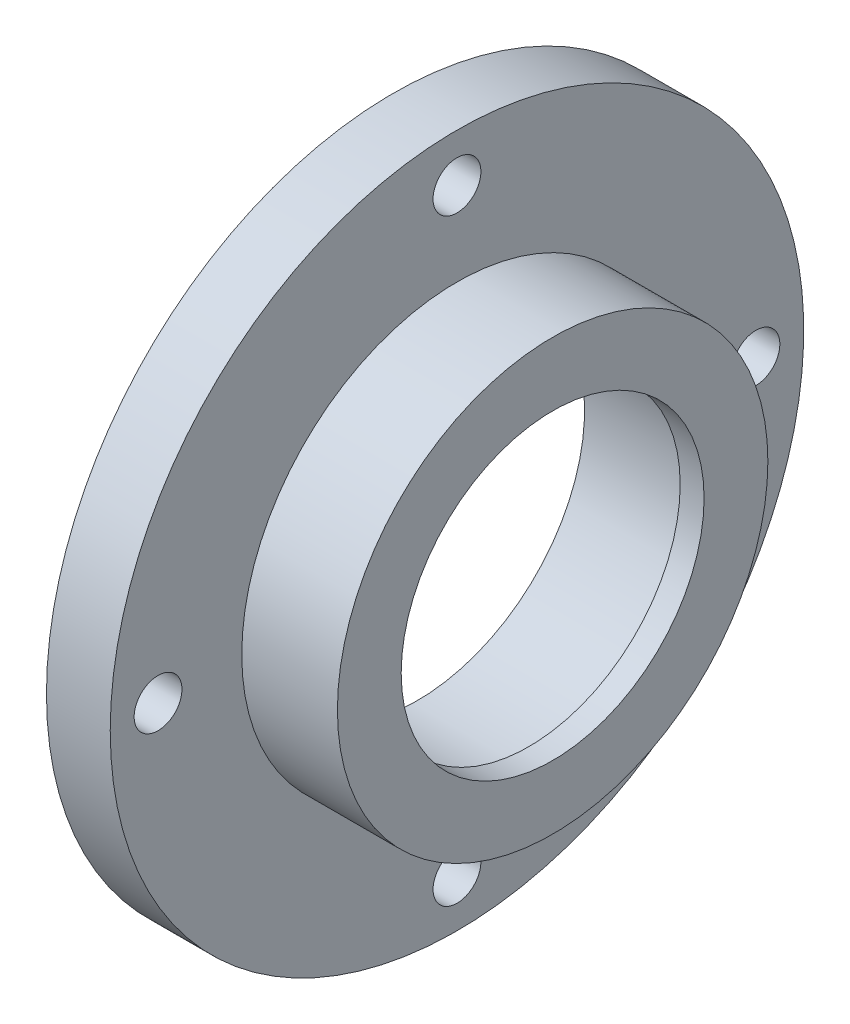
ISO-10303-21;
HEADER;
FILE_DESCRIPTION(('STEP AP214'),'2;1');
FILE_NAME('part.step','',(''),(''),'','','');
FILE_SCHEMA(('AUTOMOTIVE_DESIGN { 1 0 10303 214 1 1 1 1 }'));
ENDSEC;
DATA;
#1=APPLICATION_CONTEXT('core data for automotive mechanical design processes');
#2=APPLICATION_PROTOCOL_DEFINITION('international standard','automotive_design',2000,#1);
#3=PRODUCT_CONTEXT('',#1,'mechanical');
#4=PRODUCT('Part','Part','',(#3));
#5=PRODUCT_RELATED_PRODUCT_CATEGORY('part','',(#4));
#6=PRODUCT_DEFINITION_FORMATION('','',#4);
#7=PRODUCT_DEFINITION_CONTEXT('part definition',#1,'design');
#8=PRODUCT_DEFINITION('design','',#6,#7);
#9=PRODUCT_DEFINITION_SHAPE('','',#8);
#10=(LENGTH_UNIT() NAMED_UNIT(*) SI_UNIT(.MILLI.,.METRE.));
#11=(NAMED_UNIT(*) PLANE_ANGLE_UNIT() SI_UNIT($,.RADIAN.));
#12=(NAMED_UNIT(*) SI_UNIT($,.STERADIAN.) SOLID_ANGLE_UNIT());
#13=UNCERTAINTY_MEASURE_WITH_UNIT(LENGTH_MEASURE(1.E-05),#10,'distance_accuracy_value','');
#14=(GEOMETRIC_REPRESENTATION_CONTEXT(3) GLOBAL_UNCERTAINTY_ASSIGNED_CONTEXT((#13)) GLOBAL_UNIT_ASSIGNED_CONTEXT((#10,
#11,#12)) REPRESENTATION_CONTEXT('',''));
#15=CARTESIAN_POINT('',(0.,0.,0.));
#16=DIRECTION('',(0.,0.,1.));
#17=DIRECTION('',(1.,0.,0.));
#18=AXIS2_PLACEMENT_3D('',#15,#16,#17);
#19=CARTESIAN_POINT('',(8.,0.,-43.5));
#20=DIRECTION('',(-1.,0.,0.));
#21=DIRECTION('',(0.,0.,1.));
#22=AXIS2_PLACEMENT_3D('',#19,#20,#21);
#23=PLANE('',#22);
#24=CARTESIAN_POINT('',(8.,1.20241174019601E-12,37.5000000000012));
#25=DIRECTION('',(-1.,0.,0.));
#26=DIRECTION('',(0.,0.,1.));
#27=AXIS2_PLACEMENT_3D('',#24,#25,#26);
#28=CIRCLE('',#27,3.);
#29=CARTESIAN_POINT('',(8.,1.20241174019601E-12,40.5000000000012));
#30=VERTEX_POINT('',#29);
#31=EDGE_CURVE('E89',#30,#30,#28,.F.);
#32=ORIENTED_EDGE('',*,*,#31,.F.);
#33=EDGE_LOOP('',(#32));
#34=FACE_BOUND('',#33,.T.);
#35=CARTESIAN_POINT('',(8.,-1.20700416569281E-12,-37.4999999999988));
#36=DIRECTION('',(-1.,0.,0.));
#37=DIRECTION('',(0.,0.,1.));
#38=AXIS2_PLACEMENT_3D('',#35,#36,#37);
#39=CIRCLE('',#38,3.);
#40=CARTESIAN_POINT('',(8.,-1.20700416569281E-12,-34.4999999999988));
#41=VERTEX_POINT('',#40);
#42=EDGE_CURVE('E83',#41,#41,#39,.F.);
#43=ORIENTED_EDGE('',*,*,#42,.F.);
#44=EDGE_LOOP('',(#43));
#45=FACE_BOUND('',#44,.T.);
#46=CARTESIAN_POINT('',(8.,37.5,0.));
#47=DIRECTION('',(-1.,0.,0.));
#48=DIRECTION('',(0.,0.,1.));
#49=AXIS2_PLACEMENT_3D('',#46,#47,#48);
#50=CIRCLE('',#49,3.);
#51=CARTESIAN_POINT('',(8.,37.5,3.));
#52=VERTEX_POINT('',#51);
#53=EDGE_CURVE('E77',#52,#52,#50,.F.);
#54=ORIENTED_EDGE('',*,*,#53,.F.);
#55=EDGE_LOOP('',(#54));
#56=FACE_BOUND('',#55,.T.);
#57=CARTESIAN_POINT('',(8.,-37.5,2.40482348039201E-12));
#58=DIRECTION('',(-1.,0.,0.));
#59=DIRECTION('',(0.,0.,1.));
#60=AXIS2_PLACEMENT_3D('',#57,#58,#59);
#61=CIRCLE('',#60,3.);
#62=CARTESIAN_POINT('',(8.,-37.5,3.00000000000241));
#63=VERTEX_POINT('',#62);
#64=EDGE_CURVE('E68',#63,#63,#61,.F.);
#65=ORIENTED_EDGE('',*,*,#64,.F.);
#66=EDGE_LOOP('',(#65));
#67=FACE_BOUND('',#66,.T.);
#68=CARTESIAN_POINT('',(8.,0.,0.));
#69=DIRECTION('',(-1.,0.,0.));
#70=DIRECTION('',(0.,0.,1.));
#71=AXIS2_PLACEMENT_3D('',#68,#69,#70);
#72=CIRCLE('',#71,43.5);
#73=CARTESIAN_POINT('',(8.,0.,43.5));
#74=VERTEX_POINT('',#73);
#75=EDGE_CURVE('E10',#74,#74,#72,.T.);
#76=ORIENTED_EDGE('',*,*,#75,.F.);
#77=EDGE_LOOP('',(#76));
#78=FACE_BOUND('',#77,.T.);
#79=CARTESIAN_POINT('',(8.,0.,0.));
#80=DIRECTION('',(-1.,0.,0.));
#81=DIRECTION('',(0.,0.,1.));
#82=AXIS2_PLACEMENT_3D('',#79,#80,#81);
#83=CIRCLE('',#82,27.);
#84=CARTESIAN_POINT('',(8.,0.,27.));
#85=VERTEX_POINT('',#84);
#86=EDGE_CURVE('E65',#85,#85,#83,.T.);
#87=ORIENTED_EDGE('',*,*,#86,.T.);
#88=EDGE_LOOP('',(#87));
#89=FACE_BOUND('',#88,.T.);
#90=ADVANCED_FACE('F31',(#34,#45,#56,#67,#78,#89),#23,.F.);
#91=CARTESIAN_POINT('',(0.,0.,0.));
#92=DIRECTION('',(-1.,0.,0.));
#93=DIRECTION('',(0.,0.,1.));
#94=AXIS2_PLACEMENT_3D('',#91,#92,#93);
#95=CYLINDRICAL_SURFACE('',#94,43.5);
#96=CARTESIAN_POINT('',(0.,0.,0.));
#97=DIRECTION('',(-1.,0.,0.));
#98=DIRECTION('',(0.,0.,1.));
#99=AXIS2_PLACEMENT_3D('',#96,#97,#98);
#100=CIRCLE('',#99,43.5);
#101=CARTESIAN_POINT('',(0.,0.,43.5));
#102=VERTEX_POINT('',#101);
#103=EDGE_CURVE('E37',#102,#102,#100,.T.);
#104=ORIENTED_EDGE('',*,*,#103,.F.);
#105=EDGE_LOOP('',(#104));
#106=FACE_BOUND('',#105,.T.);
#107=ORIENTED_EDGE('',*,*,#75,.T.);
#108=EDGE_LOOP('',(#107));
#109=FACE_BOUND('',#108,.T.);
#110=ADVANCED_FACE('F97',(#106,#109),#95,.T.);
#111=CARTESIAN_POINT('',(0.,0.,-30.));
#112=DIRECTION('',(1.,0.,0.));
#113=DIRECTION('',(0.,0.,-1.));
#114=AXIS2_PLACEMENT_3D('',#111,#112,#113);
#115=PLANE('',#114);
#116=CARTESIAN_POINT('',(0.,1.20241174019601E-12,37.5000000000012));
#117=DIRECTION('',(-1.,0.,0.));
#118=DIRECTION('',(0.,0.,1.));
#119=AXIS2_PLACEMENT_3D('',#116,#117,#118);
#120=CIRCLE('',#119,3.);
#121=CARTESIAN_POINT('',(0.,1.20241174019601E-12,40.5000000000012));
#122=VERTEX_POINT('',#121);
#123=EDGE_CURVE('E86',#122,#122,#120,.T.);
#124=ORIENTED_EDGE('',*,*,#123,.F.);
#125=EDGE_LOOP('',(#124));
#126=FACE_BOUND('',#125,.T.);
#127=CARTESIAN_POINT('',(0.,-1.20700416569281E-12,-37.4999999999988));
#128=DIRECTION('',(-1.,0.,0.));
#129=DIRECTION('',(0.,0.,1.));
#130=AXIS2_PLACEMENT_3D('',#127,#128,#129);
#131=CIRCLE('',#130,3.);
#132=CARTESIAN_POINT('',(0.,-1.20700416569281E-12,-34.4999999999988));
#133=VERTEX_POINT('',#132);
#134=EDGE_CURVE('E80',#133,#133,#131,.T.);
#135=ORIENTED_EDGE('',*,*,#134,.F.);
#136=EDGE_LOOP('',(#135));
#137=FACE_BOUND('',#136,.T.);
#138=CARTESIAN_POINT('',(0.,37.5,0.));
#139=DIRECTION('',(-1.,0.,0.));
#140=DIRECTION('',(0.,0.,1.));
#141=AXIS2_PLACEMENT_3D('',#138,#139,#140);
#142=CIRCLE('',#141,3.);
#143=CARTESIAN_POINT('',(0.,37.5,3.));
#144=VERTEX_POINT('',#143);
#145=EDGE_CURVE('E74',#144,#144,#142,.T.);
#146=ORIENTED_EDGE('',*,*,#145,.F.);
#147=EDGE_LOOP('',(#146));
#148=FACE_BOUND('',#147,.T.);
#149=CARTESIAN_POINT('',(0.,-37.5,2.40482348039201E-12));
#150=DIRECTION('',(-1.,0.,0.));
#151=DIRECTION('',(0.,0.,1.));
#152=AXIS2_PLACEMENT_3D('',#149,#150,#151);
#153=CIRCLE('',#152,3.);
#154=CARTESIAN_POINT('',(0.,-37.5,3.00000000000241));
#155=VERTEX_POINT('',#154);
#156=EDGE_CURVE('E71',#155,#155,#153,.T.);
#157=ORIENTED_EDGE('',*,*,#156,.F.);
#158=EDGE_LOOP('',(#157));
#159=FACE_BOUND('',#158,.T.);
#160=CARTESIAN_POINT('',(0.,0.,0.));
#161=DIRECTION('',(-1.,0.,0.));
#162=DIRECTION('',(0.,0.,1.));
#163=AXIS2_PLACEMENT_3D('',#160,#161,#162);
#164=CIRCLE('',#163,30.);
#165=CARTESIAN_POINT('',(0.,0.,30.));
#166=VERTEX_POINT('',#165);
#167=EDGE_CURVE('E41',#166,#166,#164,.T.);
#168=ORIENTED_EDGE('',*,*,#167,.F.);
#169=EDGE_LOOP('',(#168));
#170=FACE_BOUND('',#169,.T.);
#171=ORIENTED_EDGE('',*,*,#103,.T.);
#172=EDGE_LOOP('',(#171));
#173=FACE_BOUND('',#172,.T.);
#174=ADVANCED_FACE('F147',(#126,#137,#148,#159,#170,#173),#115,.F.);
#175=CARTESIAN_POINT('',(0.,0.,0.));
#176=DIRECTION('',(-1.,0.,0.));
#177=DIRECTION('',(0.,0.,1.));
#178=AXIS2_PLACEMENT_3D('',#175,#176,#177);
#179=CYLINDRICAL_SURFACE('',#178,30.);
#180=CARTESIAN_POINT('',(3.,0.,0.));
#181=DIRECTION('',(-1.,0.,0.));
#182=DIRECTION('',(0.,0.,1.));
#183=AXIS2_PLACEMENT_3D('',#180,#181,#182);
#184=CIRCLE('',#183,30.);
#185=CARTESIAN_POINT('',(3.,0.,30.));
#186=VERTEX_POINT('',#185);
#187=EDGE_CURVE('E45',#186,#186,#184,.T.);
#188=ORIENTED_EDGE('',*,*,#187,.F.);
#189=EDGE_LOOP('',(#188));
#190=FACE_BOUND('',#189,.T.);
#191=ORIENTED_EDGE('',*,*,#167,.T.);
#192=EDGE_LOOP('',(#191));
#193=FACE_BOUND('',#192,.T.);
#194=ADVANCED_FACE('F141',(#190,#193),#179,.F.);
#195=CARTESIAN_POINT('',(3.,0.,-30.));
#196=DIRECTION('',(1.,0.,0.));
#197=DIRECTION('',(0.,0.,-1.));
#198=AXIS2_PLACEMENT_3D('',#195,#196,#197);
#199=PLANE('',#198);
#200=CARTESIAN_POINT('',(3.,0.,0.));
#201=DIRECTION('',(-1.,0.,0.));
#202=DIRECTION('',(0.,0.,1.));
#203=AXIS2_PLACEMENT_3D('',#200,#201,#202);
#204=CIRCLE('',#203,21.);
#205=CARTESIAN_POINT('',(3.,0.,21.));
#206=VERTEX_POINT('',#205);
#207=EDGE_CURVE('E50',#206,#206,#204,.T.);
#208=ORIENTED_EDGE('',*,*,#207,.F.);
#209=EDGE_LOOP('',(#208));
#210=FACE_BOUND('',#209,.T.);
#211=ORIENTED_EDGE('',*,*,#187,.T.);
#212=EDGE_LOOP('',(#211));
#213=FACE_BOUND('',#212,.T.);
#214=ADVANCED_FACE('F135',(#210,#213),#199,.F.);
#215=CARTESIAN_POINT('',(0.,0.,0.));
#216=DIRECTION('',(-1.,0.,0.));
#217=DIRECTION('',(0.,0.,1.));
#218=AXIS2_PLACEMENT_3D('',#215,#216,#217);
#219=CYLINDRICAL_SURFACE('',#218,21.);
#220=CARTESIAN_POINT('',(17.,0.,0.));
#221=DIRECTION('',(-1.,0.,0.));
#222=DIRECTION('',(0.,0.,1.));
#223=AXIS2_PLACEMENT_3D('',#220,#221,#222);
#224=CIRCLE('',#223,21.);
#225=CARTESIAN_POINT('',(17.,0.,21.));
#226=VERTEX_POINT('',#225);
#227=EDGE_CURVE('E53',#226,#226,#224,.T.);
#228=ORIENTED_EDGE('',*,*,#227,.F.);
#229=EDGE_LOOP('',(#228));
#230=FACE_BOUND('',#229,.T.);
#231=ORIENTED_EDGE('',*,*,#207,.T.);
#232=EDGE_LOOP('',(#231));
#233=FACE_BOUND('',#232,.T.);
#234=ADVANCED_FACE('F129',(#230,#233),#219,.F.);
#235=CARTESIAN_POINT('',(17.,0.,-18.9999999999999));
#236=DIRECTION('',(1.,0.,0.));
#237=DIRECTION('',(0.,0.,-1.));
#238=AXIS2_PLACEMENT_3D('',#235,#236,#237);
#239=PLANE('',#238);
#240=CARTESIAN_POINT('',(17.,0.,0.));
#241=DIRECTION('',(-1.,0.,0.));
#242=DIRECTION('',(0.,0.,1.));
#243=AXIS2_PLACEMENT_3D('',#240,#241,#242);
#244=CIRCLE('',#243,18.9999999999999);
#245=CARTESIAN_POINT('',(17.,0.,18.9999999999999));
#246=VERTEX_POINT('',#245);
#247=EDGE_CURVE('E56',#246,#246,#244,.T.);
#248=ORIENTED_EDGE('',*,*,#247,.F.);
#249=EDGE_LOOP('',(#248));
#250=FACE_BOUND('',#249,.T.);
#251=ORIENTED_EDGE('',*,*,#227,.T.);
#252=EDGE_LOOP('',(#251));
#253=FACE_BOUND('',#252,.T.);
#254=ADVANCED_FACE('F123',(#250,#253),#239,.F.);
#255=CARTESIAN_POINT('',(0.,0.,0.));
#256=DIRECTION('',(-1.,0.,0.));
#257=DIRECTION('',(0.,0.,1.));
#258=AXIS2_PLACEMENT_3D('',#255,#256,#257);
#259=CYLINDRICAL_SURFACE('',#258,18.9999999999999);
#260=CARTESIAN_POINT('',(20.,0.,0.));
#261=DIRECTION('',(-1.,0.,0.));
#262=DIRECTION('',(0.,0.,1.));
#263=AXIS2_PLACEMENT_3D('',#260,#261,#262);
#264=CIRCLE('',#263,18.9999999999999);
#265=CARTESIAN_POINT('',(20.,0.,18.9999999999999));
#266=VERTEX_POINT('',#265);
#267=EDGE_CURVE('E59',#266,#266,#264,.T.);
#268=ORIENTED_EDGE('',*,*,#267,.F.);
#269=EDGE_LOOP('',(#268));
#270=FACE_BOUND('',#269,.T.);
#271=ORIENTED_EDGE('',*,*,#247,.T.);
#272=EDGE_LOOP('',(#271));
#273=FACE_BOUND('',#272,.T.);
#274=ADVANCED_FACE('F117',(#270,#273),#259,.F.);
#275=CARTESIAN_POINT('',(20.,0.,-27.));
#276=DIRECTION('',(-1.,0.,0.));
#277=DIRECTION('',(0.,0.,1.));
#278=AXIS2_PLACEMENT_3D('',#275,#276,#277);
#279=PLANE('',#278);
#280=CARTESIAN_POINT('',(20.,0.,0.));
#281=DIRECTION('',(-1.,0.,0.));
#282=DIRECTION('',(0.,0.,1.));
#283=AXIS2_PLACEMENT_3D('',#280,#281,#282);
#284=CIRCLE('',#283,27.);
#285=CARTESIAN_POINT('',(20.,0.,27.));
#286=VERTEX_POINT('',#285);
#287=EDGE_CURVE('E62',#286,#286,#284,.T.);
#288=ORIENTED_EDGE('',*,*,#287,.F.);
#289=EDGE_LOOP('',(#288));
#290=FACE_BOUND('',#289,.T.);
#291=ORIENTED_EDGE('',*,*,#267,.T.);
#292=EDGE_LOOP('',(#291));
#293=FACE_BOUND('',#292,.T.);
#294=ADVANCED_FACE('F111',(#290,#293),#279,.F.);
#295=CARTESIAN_POINT('',(0.,0.,0.));
#296=DIRECTION('',(-1.,0.,0.));
#297=DIRECTION('',(0.,0.,1.));
#298=AXIS2_PLACEMENT_3D('',#295,#296,#297);
#299=CYLINDRICAL_SURFACE('',#298,27.);
#300=ORIENTED_EDGE('',*,*,#86,.F.);
#301=EDGE_LOOP('',(#300));
#302=FACE_BOUND('',#301,.T.);
#303=ORIENTED_EDGE('',*,*,#287,.T.);
#304=EDGE_LOOP('',(#303));
#305=FACE_BOUND('',#304,.T.);
#306=ADVANCED_FACE('F107',(#302,#305),#299,.T.);
#307=CARTESIAN_POINT('',(20.001,-37.5,2.40482348039201E-12));
#308=DIRECTION('',(-1.,0.,0.));
#309=DIRECTION('',(0.,0.,1.));
#310=AXIS2_PLACEMENT_3D('',#307,#308,#309);
#311=CYLINDRICAL_SURFACE('',#310,3.);
#312=ORIENTED_EDGE('',*,*,#156,.T.);
#313=EDGE_LOOP('',(#312));
#314=FACE_BOUND('',#313,.T.);
#315=ORIENTED_EDGE('',*,*,#64,.T.);
#316=EDGE_LOOP('',(#315));
#317=FACE_BOUND('',#316,.T.);
#318=ADVANCED_FACE('F110',(#314,#317),#311,.F.);
#319=CARTESIAN_POINT('',(20.001,37.5,0.));
#320=DIRECTION('',(-1.,0.,0.));
#321=DIRECTION('',(0.,0.,1.));
#322=AXIS2_PLACEMENT_3D('',#319,#320,#321);
#323=CYLINDRICAL_SURFACE('',#322,3.);
#324=ORIENTED_EDGE('',*,*,#145,.T.);
#325=EDGE_LOOP('',(#324));
#326=FACE_BOUND('',#325,.T.);
#327=ORIENTED_EDGE('',*,*,#53,.T.);
#328=EDGE_LOOP('',(#327));
#329=FACE_BOUND('',#328,.T.);
#330=ADVANCED_FACE('F163',(#326,#329),#323,.F.);
#331=CARTESIAN_POINT('',(20.001,-1.20700416569281E-12,-37.4999999999988));
#332=DIRECTION('',(-1.,0.,0.));
#333=DIRECTION('',(0.,0.,1.));
#334=AXIS2_PLACEMENT_3D('',#331,#332,#333);
#335=CYLINDRICAL_SURFACE('',#334,3.);
#336=ORIENTED_EDGE('',*,*,#134,.T.);
#337=EDGE_LOOP('',(#336));
#338=FACE_BOUND('',#337,.T.);
#339=ORIENTED_EDGE('',*,*,#42,.T.);
#340=EDGE_LOOP('',(#339));
#341=FACE_BOUND('',#340,.T.);
#342=ADVANCED_FACE('F167',(#338,#341),#335,.F.);
#343=CARTESIAN_POINT('',(20.001,1.20241174019601E-12,37.5000000000012));
#344=DIRECTION('',(-1.,0.,0.));
#345=DIRECTION('',(0.,0.,1.));
#346=AXIS2_PLACEMENT_3D('',#343,#344,#345);
#347=CYLINDRICAL_SURFACE('',#346,3.);
#348=ORIENTED_EDGE('',*,*,#123,.T.);
#349=EDGE_LOOP('',(#348));
#350=FACE_BOUND('',#349,.T.);
#351=ORIENTED_EDGE('',*,*,#31,.T.);
#352=EDGE_LOOP('',(#351));
#353=FACE_BOUND('',#352,.T.);
#354=ADVANCED_FACE('F93',(#350,#353),#347,.F.);
#355=CLOSED_SHELL('',(#90,#110,#174,#194,#214,#234,#254,#274,#294,#306,#318,#330,#342,#354));
#356=MANIFOLD_SOLID_BREP('B2',#355);
#357=ADVANCED_BREP_SHAPE_REPRESENTATION('',(#18,#356),#14);
#358=SHAPE_DEFINITION_REPRESENTATION(#9,#357);
ENDSEC;
END-ISO-10303-21;
